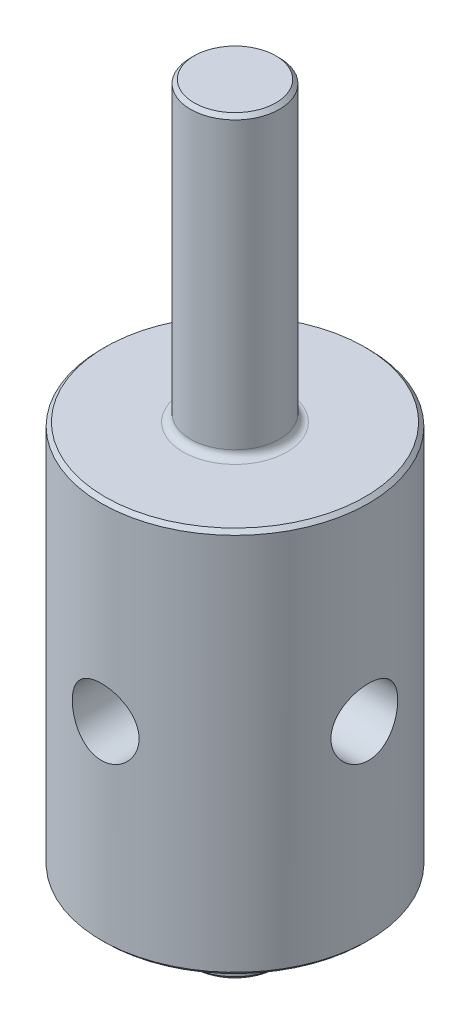
ISO-10303-21;
HEADER;
FILE_DESCRIPTION(('STEP AP214'),'2;1');
FILE_NAME('part.step','',(''),(''),'','','');
FILE_SCHEMA(('AUTOMOTIVE_DESIGN { 1 0 10303 214 1 1 1 1 }'));
ENDSEC;
DATA;
#1=APPLICATION_CONTEXT('core data for automotive mechanical design processes');
#2=APPLICATION_PROTOCOL_DEFINITION('international standard','automotive_design',2000,#1);
#3=PRODUCT_CONTEXT('',#1,'mechanical');
#4=PRODUCT('Part','Part','',(#3));
#5=PRODUCT_RELATED_PRODUCT_CATEGORY('part','',(#4));
#6=PRODUCT_DEFINITION_FORMATION('','',#4);
#7=PRODUCT_DEFINITION_CONTEXT('part definition',#1,'design');
#8=PRODUCT_DEFINITION('design','',#6,#7);
#9=PRODUCT_DEFINITION_SHAPE('','',#8);
#10=(LENGTH_UNIT() NAMED_UNIT(*) SI_UNIT(.MILLI.,.METRE.));
#11=(NAMED_UNIT(*) PLANE_ANGLE_UNIT() SI_UNIT($,.RADIAN.));
#12=(NAMED_UNIT(*) SI_UNIT($,.STERADIAN.) SOLID_ANGLE_UNIT());
#13=UNCERTAINTY_MEASURE_WITH_UNIT(LENGTH_MEASURE(1.E-05),#10,'distance_accuracy_value','');
#14=(GEOMETRIC_REPRESENTATION_CONTEXT(3) GLOBAL_UNCERTAINTY_ASSIGNED_CONTEXT((#13)) GLOBAL_UNIT_ASSIGNED_CONTEXT((#10,
#11,#12)) REPRESENTATION_CONTEXT('',''));
#15=CARTESIAN_POINT('',(0.,0.,0.));
#16=DIRECTION('',(0.,0.,1.));
#17=DIRECTION('',(1.,0.,0.));
#18=AXIS2_PLACEMENT_3D('',#15,#16,#17);
#19=CARTESIAN_POINT('',(3.,-17.5,0.));
#20=DIRECTION('',(0.,-1.,0.));
#21=DIRECTION('',(0.,0.,-1.));
#22=AXIS2_PLACEMENT_3D('',#19,#20,#21);
#23=PLANE('',#22);
#24=CARTESIAN_POINT('',(0.,-17.5,0.));
#25=DIRECTION('',(0.,-1.,0.));
#26=DIRECTION('',(0.,0.,-1.));
#27=AXIS2_PLACEMENT_3D('',#24,#25,#26);
#28=CIRCLE('',#27,2.75);
#29=CARTESIAN_POINT('',(0.,-17.5,-2.75));
#30=VERTEX_POINT('',#29);
#31=EDGE_CURVE('E75',#30,#30,#28,.T.);
#32=ORIENTED_EDGE('',*,*,#31,.T.);
#33=EDGE_LOOP('',(#32));
#34=FACE_BOUND('',#33,.T.);
#35=ADVANCED_FACE('F37',(#34),#23,.T.);
#36=CARTESIAN_POINT('',(0.,33.,0.));
#37=DIRECTION('',(0.,1.,0.));
#38=DIRECTION('',(0.,0.,1.));
#39=AXIS2_PLACEMENT_3D('',#36,#37,#38);
#40=PLANE('',#39);
#41=CARTESIAN_POINT('',(0.,33.,0.));
#42=DIRECTION('',(0.,1.,0.));
#43=DIRECTION('',(0.,0.,1.));
#44=AXIS2_PLACEMENT_3D('',#41,#42,#43);
#45=CIRCLE('',#44,2.75);
#46=CARTESIAN_POINT('',(0.,33.,2.75));
#47=VERTEX_POINT('',#46);
#48=EDGE_CURVE('E84',#47,#47,#45,.T.);
#49=ORIENTED_EDGE('',*,*,#48,.T.);
#50=EDGE_LOOP('',(#49));
#51=FACE_BOUND('',#50,.T.);
#52=ADVANCED_FACE('F126',(#51),#40,.T.);
#53=CARTESIAN_POINT('',(0.,0.,0.));
#54=DIRECTION('',(0.,-1.,0.));
#55=DIRECTION('',(0.,0.,-1.));
#56=AXIS2_PLACEMENT_3D('',#53,#54,#55);
#57=CYLINDRICAL_SURFACE('',#56,3.);
#58=CARTESIAN_POINT('',(0.,32.75,0.));
#59=DIRECTION('',(0.,1.,0.));
#60=DIRECTION('',(0.,0.,1.));
#61=AXIS2_PLACEMENT_3D('',#58,#59,#60);
#62=CIRCLE('',#61,3.);
#63=CARTESIAN_POINT('',(0.,32.75,3.));
#64=VERTEX_POINT('',#63);
#65=EDGE_CURVE('E81',#64,#64,#62,.F.);
#66=ORIENTED_EDGE('',*,*,#65,.T.);
#67=EDGE_LOOP('',(#66));
#68=FACE_BOUND('',#67,.T.);
#69=CARTESIAN_POINT('',(0.,13.5,0.));
#70=DIRECTION('',(0.,1.,0.));
#71=DIRECTION('',(0.,0.,1.));
#72=AXIS2_PLACEMENT_3D('',#69,#70,#71);
#73=CIRCLE('',#72,3.);
#74=CARTESIAN_POINT('',(0.,13.5,3.));
#75=VERTEX_POINT('',#74);
#76=EDGE_CURVE('E72',#75,#75,#73,.T.);
#77=ORIENTED_EDGE('',*,*,#76,.T.);
#78=EDGE_LOOP('',(#77));
#79=FACE_BOUND('',#78,.T.);
#80=ADVANCED_FACE('F132',(#68,#79),#57,.T.);
#81=CARTESIAN_POINT('',(9.,13.,0.));
#82=DIRECTION('',(0.,1.,0.));
#83=DIRECTION('',(0.,0.,1.));
#84=AXIS2_PLACEMENT_3D('',#81,#82,#83);
#85=PLANE('',#84);
#86=CARTESIAN_POINT('',(0.,13.,0.));
#87=DIRECTION('',(0.,1.,0.));
#88=DIRECTION('',(0.,0.,1.));
#89=AXIS2_PLACEMENT_3D('',#86,#87,#88);
#90=CIRCLE('',#89,8.74999999999999);
#91=CARTESIAN_POINT('',(0.,13.,8.74999999999999));
#92=VERTEX_POINT('',#91);
#93=EDGE_CURVE('E11',#92,#92,#90,.T.);
#94=ORIENTED_EDGE('',*,*,#93,.T.);
#95=EDGE_LOOP('',(#94));
#96=FACE_BOUND('',#95,.T.);
#97=CARTESIAN_POINT('',(0.,13.,0.));
#98=DIRECTION('',(0.,1.,0.));
#99=DIRECTION('',(0.,0.,1.));
#100=AXIS2_PLACEMENT_3D('',#97,#98,#99);
#101=CIRCLE('',#100,3.5);
#102=CARTESIAN_POINT('',(0.,13.,3.5));
#103=VERTEX_POINT('',#102);
#104=EDGE_CURVE('E69',#103,#103,#101,.F.);
#105=ORIENTED_EDGE('',*,*,#104,.T.);
#106=EDGE_LOOP('',(#105));
#107=FACE_BOUND('',#106,.T.);
#108=ADVANCED_FACE('F154',(#96,#107),#85,.T.);
#109=CARTESIAN_POINT('',(0.,0.,0.));
#110=DIRECTION('',(0.,-1.,0.));
#111=DIRECTION('',(0.,0.,-1.));
#112=AXIS2_PLACEMENT_3D('',#109,#110,#111);
#113=CYLINDRICAL_SURFACE('',#112,9.);
#114=CARTESIAN_POINT('',(0.,-12.75,0.));
#115=DIRECTION('',(0.,-1.,0.));
#116=DIRECTION('',(0.,0.,-1.));
#117=AXIS2_PLACEMENT_3D('',#114,#115,#116);
#118=CIRCLE('',#117,9.);
#119=CARTESIAN_POINT('',(0.,-12.75,-9.));
#120=VERTEX_POINT('',#119);
#121=EDGE_CURVE('E45',#120,#120,#118,.F.);
#122=ORIENTED_EDGE('',*,*,#121,.T.);
#123=EDGE_LOOP('',(#122));
#124=FACE_BOUND('',#123,.T.);
#125=CARTESIAN_POINT('',(0.,12.75,0.));
#126=DIRECTION('',(0.,1.,0.));
#127=DIRECTION('',(0.,0.,1.));
#128=AXIS2_PLACEMENT_3D('',#125,#126,#127);
#129=CIRCLE('',#128,9.);
#130=CARTESIAN_POINT('',(0.,12.75,9.));
#131=VERTEX_POINT('',#130);
#132=EDGE_CURVE('E90',#131,#131,#129,.F.);
#133=ORIENTED_EDGE('',*,*,#132,.T.);
#134=EDGE_LOOP('',(#133));
#135=FACE_BOUND('',#134,.T.);
#136=CARTESIAN_POINT('',(2.24999999999999,0.,8.71421252896669));
#137=CARTESIAN_POINT('',(2.24999647073376,0.124245675833919,8.71421490079074));
#138=CARTESIAN_POINT('',(2.23967362094788,0.248530408810669,8.71689875413138));
#139=CARTESIAN_POINT('',(2.19872081291741,0.493530820356157,8.72731675793308));
#140=CARTESIAN_POINT('',(2.16807903606789,0.614244379021365,8.73505384759467));
#141=CARTESIAN_POINT('',(2.08754207966883,0.848523184368461,8.75464852136536));
#142=CARTESIAN_POINT('',(2.03767175506903,0.962097439847133,8.76650078421412));
#143=CARTESIAN_POINT('',(1.92016902713524,1.17927976728589,8.79298372825883));
#144=CARTESIAN_POINT('',(1.85253586970461,1.28288741587219,8.80761452740641));
#145=CARTESIAN_POINT('',(1.69983758458069,1.47947548073599,8.83836644720063));
#146=CARTESIAN_POINT('',(1.61445319893364,1.57220424031504,8.85451137860731));
#147=CARTESIAN_POINT('',(1.42936385769059,1.7421852549243,8.88626587963765));
#148=CARTESIAN_POINT('',(1.32965756476227,1.81943606305957,8.9018753990975));
#149=CARTESIAN_POINT('',(1.11703068097106,1.95729792086814,8.93106373968524));
#150=CARTESIAN_POINT('',(1.0039451185756,2.01766174934531,8.94461118660534));
#151=CARTESIAN_POINT('',(0.768836865863483,2.11842867973777,8.96787730733386));
#152=CARTESIAN_POINT('',(0.646815497212744,2.15883472672396,8.9775965460091));
#153=CARTESIAN_POINT('',(0.399922882878743,2.21773305112072,8.99194282963362));
#154=CARTESIAN_POINT('',(0.275159447594076,2.23665267989392,8.99666904459883));
#155=CARTESIAN_POINT('',(0.0241459373364916,2.25338254134799,9.00084234696568));
#156=CARTESIAN_POINT('',(-0.102103915084262,2.25119589498863,9.00029021487035));
#157=CARTESIAN_POINT('',(-0.349542556137871,2.22608263477486,8.9940428545818));
#158=CARTESIAN_POINT('',(-0.4707814851024,2.20361730745152,8.98846202106784));
#159=CARTESIAN_POINT('',(-0.707711056680792,2.13932585695634,8.97291752872372));
#160=CARTESIAN_POINT('',(-0.823401403583483,2.09749870316032,8.96295363658607));
#161=CARTESIAN_POINT('',(-1.04716508287906,1.99529768638164,8.93958758730796));
#162=CARTESIAN_POINT('',(-1.15516014697463,1.93475965980442,8.9261551772551));
#163=CARTESIAN_POINT('',(-1.3596201502661,1.79697988879536,8.89730913428723));
#164=CARTESIAN_POINT('',(-1.45608307894238,1.71973523829543,8.88189515687385));
#165=CARTESIAN_POINT('',(-1.63749157894114,1.54826213221586,8.85027342392421));
#166=CARTESIAN_POINT('',(-1.72205477791919,1.45363059688702,8.83405547572768));
#167=CARTESIAN_POINT('',(-1.87419684591679,1.25136002381374,8.80303539165595));
#168=CARTESIAN_POINT('',(-1.94177492110356,1.143720378458,8.7882333219746));
#169=CARTESIAN_POINT('',(-2.05827329030081,0.917738969266022,8.76168447146387));
#170=CARTESIAN_POINT('',(-2.10710152568351,0.799347842718474,8.74995285345307));
#171=CARTESIAN_POINT('',(-2.18404264643185,0.555673078730839,8.73106776133802));
#172=CARTESIAN_POINT('',(-2.21215996474439,0.430390922413861,8.7239133075846));
#173=CARTESIAN_POINT('',(-2.24624667479932,0.180036448623072,8.71519820406711));
#174=CARTESIAN_POINT('',(-2.2527814265272,0.055045985993078,8.71349480079241));
#175=CARTESIAN_POINT('',(-2.24506529146364,-0.194239742926728,8.71548609028224));
#176=CARTESIAN_POINT('',(-2.23081631806481,-0.318535072154497,8.71918028613271));
#177=CARTESIAN_POINT('',(-2.18243291754442,-0.560802838453714,8.73141373786482));
#178=CARTESIAN_POINT('',(-2.14862766145371,-0.678845453912277,8.73987273218279));
#179=CARTESIAN_POINT('',(-2.06245627350341,-0.907588312067992,8.76060646436525));
#180=CARTESIAN_POINT('',(-2.01008794294125,-1.0182876831502,8.77288165421767));
#181=CARTESIAN_POINT('',(-1.88709360114293,-1.2315971500802,8.80016523385961));
#182=CARTESIAN_POINT('',(-1.81612957845207,-1.33400595603868,8.81522251746521));
#183=CARTESIAN_POINT('',(-1.65838565910251,-1.52566952652132,8.84625374764002));
#184=CARTESIAN_POINT('',(-1.57160316331223,-1.61492212498509,8.86222784455476));
#185=CARTESIAN_POINT('',(-1.38209112221563,-1.78002993831383,8.89377662728596));
#186=CARTESIAN_POINT('',(-1.27901689319608,-1.85549405629392,8.90933131855692));
#187=CARTESIAN_POINT('',(-1.06133103606301,-1.98804228025612,8.93787494952321));
#188=CARTESIAN_POINT('',(-0.946720010154576,-2.04512734494738,8.95086402303554));
#189=CARTESIAN_POINT('',(-0.710005953894951,-2.13880143107513,8.97273104164493));
#190=CARTESIAN_POINT('',(-0.587964107312732,-2.17553785594115,8.98163847020169));
#191=CARTESIAN_POINT('',(-0.339186960717314,-2.22791430114757,8.9944676405621));
#192=CARTESIAN_POINT('',(-0.21245257134279,-2.24355839286513,8.9983903445408));
#193=CARTESIAN_POINT('',(0.0384379344974779,-2.25307707654496,9.00076881169814));
#194=CARTESIAN_POINT('',(0.16257111067355,-2.24752884546466,8.99936952479974));
#195=CARTESIAN_POINT('',(0.408076866933189,-2.21614238858771,8.99158267029248));
#196=CARTESIAN_POINT('',(0.529449529007088,-2.19030476622036,8.98519525103631));
#197=CARTESIAN_POINT('',(0.76538483020074,-2.11938250551555,8.96817223921251));
#198=CARTESIAN_POINT('',(0.87998061280694,-2.07440223004264,8.95755970130383));
#199=CARTESIAN_POINT('',(1.10006336934365,-1.96656619720596,8.93320400055731));
#200=CARTESIAN_POINT('',(1.20554919284767,-1.9037081864914,8.91946044312205));
#201=CARTESIAN_POINT('',(1.40715433895243,-1.76014072350869,8.88991311780646));
#202=CARTESIAN_POINT('',(1.50298872367125,-1.67903967846638,8.87406788118746));
#203=CARTESIAN_POINT('',(1.67988379561538,-1.50204858305096,8.84228960378677));
#204=CARTESIAN_POINT('',(1.76094073142232,-1.40615478874988,8.8263565417643));
#205=CARTESIAN_POINT('',(1.90746455956161,-1.20014681807371,8.79586820652381));
#206=CARTESIAN_POINT('',(1.97261239368685,-1.08980072242817,8.781344182649));
#207=CARTESIAN_POINT('',(2.0833355173173,-0.859375147781654,8.75573899863364));
#208=CARTESIAN_POINT('',(2.12892504694234,-0.739302826288843,8.74465533524731));
#209=CARTESIAN_POINT('',(2.19245068928475,-0.516201723370887,8.72891794689159));
#210=CARTESIAN_POINT('',(2.21398463384297,-0.414240380131191,8.72344491757873));
#211=CARTESIAN_POINT('',(2.24276015828647,-0.208195044755201,8.71609136810896));
#212=CARTESIAN_POINT('',(2.25000295733643,-0.104111234450095,8.71421054150493));
#213=CARTESIAN_POINT('',(2.24999999999999,0.,8.71421252896669));
#214=B_SPLINE_CURVE_WITH_KNOTS('',3,(#136,#137,#138,#139,#140,#141,#142,#143,#144,#145,#146,
#147,#148,#149,#150,#151,#152,#153,#154,#155,#156,#157,#158,#159,#160,#161,#162,#163,#164,#165,
#166,#167,#168,#169,#170,#171,#172,#173,#174,#175,#176,#177,#178,#179,#180,#181,#182,#183,#184,
#185,#186,#187,#188,#189,#190,#191,#192,#193,#194,#195,#196,#197,#198,#199,#200,#201,#202,#203,
#204,#205,#206,#207,#208,#209,#210,#211,#212,#213),.UNSPECIFIED.,.T.,.F.,(4,2,2,2,2,2,2,2,2,2,2,
2,2,2,2,2,2,2,2,2,2,2,2,2,2,2,2,2,2,2,2,2,2,2,2,2,2,2,4),(0.,0.372354697562521,
0.744926167285797,1.11701765444941,1.4891249407993,1.86861558773678,2.24814169331879,
2.63296346758127,3.01772843862382,3.39469875895811,3.77161333799417,4.14016436420051,
4.50873501052306,4.88063586828998,5.2526014692202,5.63463419914719,6.0166847807982,
6.4005878880756,6.78440880116591,7.15809217287781,7.5317411446987,7.89927664512734,
8.26685569283724,8.64164561277689,9.01649717000987,9.40072797873234,9.78493874152045,
10.1663286553068,10.5476449402258,10.9186510151916,11.2896460564373,11.6586438890819,
12.0276882516871,12.4055738692831,12.783555284134,13.1685882956202,13.5533404923751,
13.8653804446715,14.1773937759712),.UNSPECIFIED.);
#215=CARTESIAN_POINT('',(2.24999999999999,0.,8.71421252896669));
#216=VERTEX_POINT('',#215);
#217=EDGE_CURVE('E183',#216,#216,#214,.T.);
#218=ORIENTED_EDGE('',*,*,#217,.F.);
#219=EDGE_LOOP('',(#218));
#220=FACE_BOUND('',#219,.T.);
#221=CARTESIAN_POINT('',(9.,-2.24999999999999,0.));
#222=CARTESIAN_POINT('',(8.99999789802018,-2.24999651139275,-0.124314133004598));
#223=CARTESIAN_POINT('',(8.9973986719774,-2.23966267383931,-0.248667236746146));
#224=CARTESIAN_POINT('',(8.98728170744842,-2.19866227303948,-0.493809485655799));
#225=CARTESIAN_POINT('',(8.97976118129964,-2.16798418569322,-0.614596570306109));
#226=CARTESIAN_POINT('',(8.96063439498049,-2.08734111980686,-0.849031308273864));
#227=CARTESIAN_POINT('',(8.94903304263088,-2.03739930192709,-0.962687345145002));
#228=CARTESIAN_POINT('',(8.92298015711432,-1.91972791493273,-1.18000819785664));
#229=CARTESIAN_POINT('',(8.90852852781235,-1.85199774582154,-1.28367267652314));
#230=CARTESIAN_POINT('',(8.8780112038754,-1.69919881551872,-1.48020289095137));
#231=CARTESIAN_POINT('',(8.8619206072219,-1.6138326375614,-1.57283353509158));
#232=CARTESIAN_POINT('',(8.83010430176905,-1.42882169263644,-1.74262339080498));
#233=CARTESIAN_POINT('',(8.81437863434802,-1.32917531557959,-1.81978085542378));
#234=CARTESIAN_POINT('',(8.78482163547253,-1.11660715989451,-1.95753981419846));
#235=CARTESIAN_POINT('',(8.77102191697217,-1.00351015378691,-2.0178783238877));
#236=CARTESIAN_POINT('',(8.74724242227025,-0.768377382509946,-2.11859536282611));
#237=CARTESIAN_POINT('',(8.73726203541628,-0.646343050001977,-2.15897708316021));
#238=CARTESIAN_POINT('',(8.72250715044484,-0.399384752697511,-2.21783225520714));
#239=CARTESIAN_POINT('',(8.71763236495517,-0.274567655943013,-2.23672840249807));
#240=CARTESIAN_POINT('',(8.71334043689387,-0.0234471465009838,-2.25339266259961));
#241=CARTESIAN_POINT('',(8.71392240641893,0.102856021038203,-2.25116421272716));
#242=CARTESIAN_POINT('',(8.72038808275226,0.350123711618027,-2.22597978695955));
#243=CARTESIAN_POINT('',(8.72614294510941,0.471143432197992,-2.20352751028595));
#244=CARTESIAN_POINT('',(8.74210064506604,0.707641576366584,-2.13933628035449));
#245=CARTESIAN_POINT('',(8.75230379953858,0.823119604543377,-2.09759595310409));
#246=CARTESIAN_POINT('',(8.77612670858489,1.04660702437819,-1.99558421690578));
#247=CARTESIAN_POINT('',(8.78977991204724,1.15452925768435,-1.93513000084938));
#248=CARTESIAN_POINT('',(8.81894566268987,1.35887806463522,-1.79753441402242));
#249=CARTESIAN_POINT('',(8.83445853501942,1.45530262210087,-1.72039012321325));
#250=CARTESIAN_POINT('',(8.86613820809837,1.6368054235416,-1.54899513702183));
#251=CARTESIAN_POINT('',(8.88231104217002,1.72148173509202,-1.45431938724879));
#252=CARTESIAN_POINT('',(8.91308948368134,1.87383186369585,-1.25191787625555));
#253=CARTESIAN_POINT('',(8.92769504324111,1.94150516139534,-1.14419171656192));
#254=CARTESIAN_POINT('',(8.95376598141286,2.05807587933657,-0.918173833022089));
#255=CARTESIAN_POINT('',(8.96522040191591,2.10690801038163,-0.799847089812937));
#256=CARTESIAN_POINT('',(8.98361875487125,2.18387595856435,-0.556314012214327));
#257=CARTESIAN_POINT('',(8.99056355008921,2.2120157346272,-0.43110899872573));
#258=CARTESIAN_POINT('',(8.99903248907063,2.24618634833825,-0.180809955585044));
#259=CARTESIAN_POINT('',(9.00069080262418,2.25276453911294,-0.0557950799823191));
#260=CARTESIAN_POINT('',(8.99878207221676,2.24512649691676,0.193549312202257));
#261=CARTESIAN_POINT('',(8.9952154986277,2.23091213580129,0.317878889466887));
#262=CARTESIAN_POINT('',(8.98334371691036,2.18254363741292,0.560421403164731));
#263=CARTESIAN_POINT('',(8.97510951278717,2.14868810478451,0.678697678453124));
#264=CARTESIAN_POINT('',(8.95483059951201,2.06233937395732,0.907885938678759));
#265=CARTESIAN_POINT('',(8.94278550554838,2.00984429353024,1.01879717854894));
#266=CARTESIAN_POINT('',(8.91589961889466,1.8866458066879,1.23228470164476));
#267=CARTESIAN_POINT('',(8.90101301050399,1.81563583140485,1.33467816275374));
#268=CARTESIAN_POINT('',(8.87016763781129,1.65781513680454,1.52628992046486));
#269=CARTESIAN_POINT('',(8.85420868877558,1.57100169057463,1.6155059384595));
#270=CARTESIAN_POINT('',(8.82253435441157,1.3814970587333,1.78048585210909));
#271=CARTESIAN_POINT('',(8.80683456280922,1.27846844549636,1.85586580143304));
#272=CARTESIAN_POINT('',(8.77789317565859,1.06090104830142,1.98826613851904));
#273=CARTESIAN_POINT('',(8.7646514710054,0.946362775560368,2.04528734123689));
#274=CARTESIAN_POINT('',(8.74227142101998,0.709641416380381,2.13892713091393));
#275=CARTESIAN_POINT('',(8.73310882937859,0.587508557483985,2.17566659498109));
#276=CARTESIAN_POINT('',(8.71990116135276,0.338535543166336,2.22801848993066));
#277=CARTESIAN_POINT('',(8.71585496579905,0.211696423451264,2.24363554121798));
#278=CARTESIAN_POINT('',(8.71342351805936,-0.0391815357828033,2.25305788550098));
#279=CARTESIAN_POINT('',(8.71487899092396,-0.163196152687095,2.24747684667017));
#280=CARTESIAN_POINT('',(8.72291863511765,-0.408455833001969,2.21606591746929));
#281=CARTESIAN_POINT('',(8.72950270337786,-0.529700952020473,2.19023643403014));
#282=CARTESIAN_POINT('',(8.74696891024084,-0.765312688598109,2.11939697916418));
#283=CARTESIAN_POINT('',(8.75782522854464,-0.879715957860307,2.07450210702055));
#284=CARTESIAN_POINT('',(8.78261633587243,-1.09944807407053,1.9668973704076));
#285=CARTESIAN_POINT('',(8.7965515518116,-1.20477565978037,1.90418503505127));
#286=CARTESIAN_POINT('',(8.82638451395269,-1.40633194350303,1.7608016229557));
#287=CARTESIAN_POINT('',(8.84232397247636,-1.50225161013593,1.67970474436837));
#288=CARTESIAN_POINT('',(8.87412040869429,-1.67932056719311,1.50268405678459));
#289=CARTESIAN_POINT('',(8.8899773659059,-1.76046634516945,1.40675673189171));
#290=CARTESIAN_POINT('',(8.92016483471495,-1.9071169628469,1.20070138005388));
#291=CARTESIAN_POINT('',(8.93446250048802,-1.97231192050736,1.09034763347457));
#292=CARTESIAN_POINT('',(8.95957387462678,-2.08312119441079,0.859899089265708));
#293=CARTESIAN_POINT('',(8.97039007799672,-2.1287495409728,0.739811345155103));
#294=CARTESIAN_POINT('',(8.98572089348313,-2.19235774549447,0.516615379865202));
#295=CARTESIAN_POINT('',(8.99103877579036,-2.21392686458014,0.414570256362098));
#296=CARTESIAN_POINT('',(8.99817907847923,-2.2427489154329,0.208359107304421));
#297=CARTESIAN_POINT('',(9.00000176176341,-2.25000292395794,0.104193241863922));
#298=CARTESIAN_POINT('',(9.,-2.24999999999999,0.));
#299=B_SPLINE_CURVE_WITH_KNOTS('',3,(#221,#222,#223,#224,#225,#226,#227,#228,#229,#230,#231,
#232,#233,#234,#235,#236,#237,#238,#239,#240,#241,#242,#243,#244,#245,#246,#247,#248,#249,#250,
#251,#252,#253,#254,#255,#256,#257,#258,#259,#260,#261,#262,#263,#264,#265,#266,#267,#268,#269,
#270,#271,#272,#273,#274,#275,#276,#277,#278,#279,#280,#281,#282,#283,#284,#285,#286,#287,#288,
#289,#290,#291,#292,#293,#294,#295,#296,#297,#298),.UNSPECIFIED.,.T.,.F.,(4,2,2,2,2,2,2,2,2,2,2,
2,2,2,2,2,2,2,2,2,2,2,2,2,2,2,2,2,2,2,2,2,2,2,2,2,2,2,4),(0.,0.372560568707833,
0.745332356645847,1.11765735342915,1.48999491025399,1.86921653155708,2.24848094370092,
2.63337971318709,3.01821691754052,3.39534442651604,3.77241057174025,4.14033745515507,
4.50829055204037,4.87995791815798,5.25169036259223,5.63402251458508,6.0163663434235,
6.4000234351865,6.78360710537943,7.15737463428893,7.53110851674093,7.89930411776034,
8.26753690988414,8.64230381353006,9.01713544517006,9.40116763811692,9.7851827812924,
10.1668838192603,10.5485013488359,10.919156706029,11.2898046143903,11.6582460084415,
12.0267385221033,12.4048436461984,12.783038546606,13.1680827825436,13.55285045737,
13.865133644182,14.1773933406954),.UNSPECIFIED.);
#300=CARTESIAN_POINT('',(9.,-2.24999999999999,0.));
#301=VERTEX_POINT('',#300);
#302=EDGE_CURVE('E56',#301,#301,#299,.T.);
#303=ORIENTED_EDGE('',*,*,#302,.F.);
#304=EDGE_LOOP('',(#303));
#305=FACE_BOUND('',#304,.T.);
#306=CARTESIAN_POINT('',(-8.71421252896669,0.,2.24999999999999));
#307=CARTESIAN_POINT('',(-8.71421490079075,0.124245675833919,2.24999647073376));
#308=CARTESIAN_POINT('',(-8.71689875413138,0.248530408810669,2.23967362094788));
#309=CARTESIAN_POINT('',(-8.72731675793308,0.493530820356157,2.19872081291741));
#310=CARTESIAN_POINT('',(-8.73505384759467,0.614244379021365,2.16807903606789));
#311=CARTESIAN_POINT('',(-8.75464852136536,0.848523184368461,2.08754207966883));
#312=CARTESIAN_POINT('',(-8.76650078421412,0.962097439847134,2.03767175506903));
#313=CARTESIAN_POINT('',(-8.79298372825883,1.17927976728589,1.92016902713524));
#314=CARTESIAN_POINT('',(-8.80761452740641,1.28288741587219,1.85253586970461));
#315=CARTESIAN_POINT('',(-8.83836644720063,1.47947548073599,1.69983758458069));
#316=CARTESIAN_POINT('',(-8.85451137860731,1.57220424031504,1.61445319893364));
#317=CARTESIAN_POINT('',(-8.88626587963765,1.7421852549243,1.42936385769059));
#318=CARTESIAN_POINT('',(-8.9018753990975,1.81943606305957,1.32965756476227));
#319=CARTESIAN_POINT('',(-8.93106373968524,1.95729792086814,1.11703068097105));
#320=CARTESIAN_POINT('',(-8.94461118660534,2.01766174934531,1.0039451185756));
#321=CARTESIAN_POINT('',(-8.96787730733386,2.11842867973777,0.768836865863482));
#322=CARTESIAN_POINT('',(-8.9775965460091,2.15883472672396,0.646815497212743));
#323=CARTESIAN_POINT('',(-8.99194282963362,2.21773305112072,0.399922882878743));
#324=CARTESIAN_POINT('',(-8.99666904459883,2.23665267989392,0.275159447594076));
#325=CARTESIAN_POINT('',(-9.00084234696568,2.25338254134799,0.0241459373364911));
#326=CARTESIAN_POINT('',(-9.00029021487035,2.25119589498863,-0.102103915084263));
#327=CARTESIAN_POINT('',(-8.9940428545818,2.22608263477486,-0.349542556137871));
#328=CARTESIAN_POINT('',(-8.98846202106784,2.20361730745152,-0.4707814851024));
#329=CARTESIAN_POINT('',(-8.97291752872372,2.13932585695634,-0.707711056680792));
#330=CARTESIAN_POINT('',(-8.96295363658607,2.09749870316032,-0.823401403583484));
#331=CARTESIAN_POINT('',(-8.93958758730796,1.99529768638164,-1.04716508287906));
#332=CARTESIAN_POINT('',(-8.9261551772551,1.93475965980442,-1.15516014697463));
#333=CARTESIAN_POINT('',(-8.89730913428723,1.79697988879536,-1.3596201502661));
#334=CARTESIAN_POINT('',(-8.88189515687385,1.71973523829543,-1.45608307894239));
#335=CARTESIAN_POINT('',(-8.85027342392421,1.54826213221586,-1.63749157894115));
#336=CARTESIAN_POINT('',(-8.83405547572768,1.45363059688702,-1.72205477791919));
#337=CARTESIAN_POINT('',(-8.80303539165595,1.25136002381374,-1.87419684591679));
#338=CARTESIAN_POINT('',(-8.7882333219746,1.143720378458,-1.94177492110356));
#339=CARTESIAN_POINT('',(-8.76168447146387,0.917738969266021,-2.05827329030081));
#340=CARTESIAN_POINT('',(-8.74995285345307,0.799347842718473,-2.10710152568351));
#341=CARTESIAN_POINT('',(-8.73106776133802,0.555673078730838,-2.18404264643185));
#342=CARTESIAN_POINT('',(-8.7239133075846,0.43039092241386,-2.21215996474439));
#343=CARTESIAN_POINT('',(-8.71519820406711,0.180036448623071,-2.24624667479932));
#344=CARTESIAN_POINT('',(-8.71349480079241,0.0550459859930763,-2.2527814265272));
#345=CARTESIAN_POINT('',(-8.71548609028224,-0.19423974292673,-2.24506529146364));
#346=CARTESIAN_POINT('',(-8.71918028613271,-0.318535072154498,-2.23081631806481));
#347=CARTESIAN_POINT('',(-8.73141373786482,-0.560802838453716,-2.18243291754442));
#348=CARTESIAN_POINT('',(-8.73987273218279,-0.678845453912278,-2.14862766145371));
#349=CARTESIAN_POINT('',(-8.76060646436525,-0.907588312067993,-2.06245627350341));
#350=CARTESIAN_POINT('',(-8.77288165421767,-1.0182876831502,-2.01008794294124));
#351=CARTESIAN_POINT('',(-8.80016523385961,-1.2315971500802,-1.88709360114293));
#352=CARTESIAN_POINT('',(-8.81522251746521,-1.33400595603868,-1.81612957845207));
#353=CARTESIAN_POINT('',(-8.84625374764002,-1.52566952652132,-1.65838565910251));
#354=CARTESIAN_POINT('',(-8.86222784455476,-1.61492212498509,-1.57160316331223));
#355=CARTESIAN_POINT('',(-8.89377662728596,-1.78002993831383,-1.38209112221563));
#356=CARTESIAN_POINT('',(-8.90933131855692,-1.85549405629392,-1.27901689319608));
#357=CARTESIAN_POINT('',(-8.93787494952321,-1.98804228025612,-1.06133103606301));
#358=CARTESIAN_POINT('',(-8.95086402303554,-2.04512734494738,-0.946720010154575));
#359=CARTESIAN_POINT('',(-8.97273104164493,-2.13880143107513,-0.71000595389495));
#360=CARTESIAN_POINT('',(-8.98163847020169,-2.17553785594115,-0.587964107312732));
#361=CARTESIAN_POINT('',(-8.9944676405621,-2.22791430114757,-0.339186960717313));
#362=CARTESIAN_POINT('',(-8.9983903445408,-2.24355839286513,-0.212452571342789));
#363=CARTESIAN_POINT('',(-9.00076881169814,-2.25307707654496,0.0384379344974786));
#364=CARTESIAN_POINT('',(-8.99936952479974,-2.24752884546466,0.16257111067355));
#365=CARTESIAN_POINT('',(-8.99158267029248,-2.21614238858771,0.40807686693319));
#366=CARTESIAN_POINT('',(-8.98519525103631,-2.19030476622036,0.529449529007089));
#367=CARTESIAN_POINT('',(-8.96817223921251,-2.11938250551555,0.765384830200741));
#368=CARTESIAN_POINT('',(-8.95755970130383,-2.07440223004264,0.87998061280694));
#369=CARTESIAN_POINT('',(-8.9332040005573,-1.96656619720595,1.10006336934365));
#370=CARTESIAN_POINT('',(-8.91946044312205,-1.9037081864914,1.20554919284767));
#371=CARTESIAN_POINT('',(-8.88991311780646,-1.76014072350869,1.40715433895243));
#372=CARTESIAN_POINT('',(-8.87406788118746,-1.67903967846638,1.50298872367125));
#373=CARTESIAN_POINT('',(-8.84228960378677,-1.50204858305096,1.67988379561538));
#374=CARTESIAN_POINT('',(-8.8263565417643,-1.40615478874988,1.76094073142232));
#375=CARTESIAN_POINT('',(-8.79586820652381,-1.20014681807371,1.90746455956161));
#376=CARTESIAN_POINT('',(-8.781344182649,-1.08980072242817,1.97261239368685));
#377=CARTESIAN_POINT('',(-8.75573899863363,-0.859375147781653,2.0833355173173));
#378=CARTESIAN_POINT('',(-8.74465533524731,-0.739302826288842,2.12892504694234));
#379=CARTESIAN_POINT('',(-8.72891794689159,-0.516201723370886,2.19245068928475));
#380=CARTESIAN_POINT('',(-8.72344491757873,-0.41424038013119,2.21398463384297));
#381=CARTESIAN_POINT('',(-8.71609136810896,-0.208195044755201,2.24276015828647));
#382=CARTESIAN_POINT('',(-8.71421054150493,-0.104111234450094,2.25000295733643));
#383=CARTESIAN_POINT('',(-8.71421252896669,0.,2.24999999999999));
#384=B_SPLINE_CURVE_WITH_KNOTS('',3,(#306,#307,#308,#309,#310,#311,#312,#313,#314,#315,#316,
#317,#318,#319,#320,#321,#322,#323,#324,#325,#326,#327,#328,#329,#330,#331,#332,#333,#334,#335,
#336,#337,#338,#339,#340,#341,#342,#343,#344,#345,#346,#347,#348,#349,#350,#351,#352,#353,#354,
#355,#356,#357,#358,#359,#360,#361,#362,#363,#364,#365,#366,#367,#368,#369,#370,#371,#372,#373,
#374,#375,#376,#377,#378,#379,#380,#381,#382,#383),.UNSPECIFIED.,.T.,.F.,(4,2,2,2,2,2,2,2,2,2,2,
2,2,2,2,2,2,2,2,2,2,2,2,2,2,2,2,2,2,2,2,2,2,2,2,2,2,2,4),(0.,0.372354697562522,
0.744926167285797,1.11701765444942,1.4891249407993,1.86861558773678,2.24814169331879,
2.63296346758127,3.01772843862382,3.39469875895811,3.77161333799417,4.14016436420051,
4.50873501052306,4.88063586828998,5.2526014692202,5.63463419914719,6.0166847807982,
6.4005878880756,6.78440880116591,7.15809217287782,7.5317411446987,7.89927664512734,
8.26685569283724,8.64164561277689,9.01649717000988,9.40072797873234,9.78493874152045,
10.1663286553068,10.5476449402258,10.9186510151916,11.2896460564373,11.6586438890819,
12.0276882516871,12.4055738692831,12.783555284134,13.1685882956202,13.5533404923751,
13.8653804446715,14.1773937759712),.UNSPECIFIED.);
#385=CARTESIAN_POINT('',(-8.71421252896669,0.,2.24999999999999));
#386=VERTEX_POINT('',#385);
#387=EDGE_CURVE('E170',#386,#386,#384,.T.);
#388=ORIENTED_EDGE('',*,*,#387,.F.);
#389=EDGE_LOOP('',(#388));
#390=FACE_BOUND('',#389,.T.);
#391=ADVANCED_FACE('F95',(#124,#135,#220,#305,#390),#113,.T.);
#392=CARTESIAN_POINT('',(3.,-13.,0.));
#393=DIRECTION('',(0.,-1.,0.));
#394=DIRECTION('',(0.,0.,-1.));
#395=AXIS2_PLACEMENT_3D('',#392,#393,#394);
#396=PLANE('',#395);
#397=CARTESIAN_POINT('',(0.,-13.,0.));
#398=DIRECTION('',(0.,-1.,0.));
#399=DIRECTION('',(0.,0.,-1.));
#400=AXIS2_PLACEMENT_3D('',#397,#398,#399);
#401=CIRCLE('',#400,8.75000000000001);
#402=CARTESIAN_POINT('',(0.,-13.,-8.75000000000001));
#403=VERTEX_POINT('',#402);
#404=EDGE_CURVE('E87',#403,#403,#401,.T.);
#405=ORIENTED_EDGE('',*,*,#404,.T.);
#406=EDGE_LOOP('',(#405));
#407=FACE_BOUND('',#406,.T.);
#408=CARTESIAN_POINT('',(0.,-13.,0.));
#409=DIRECTION('',(0.,-1.,0.));
#410=DIRECTION('',(0.,0.,-1.));
#411=AXIS2_PLACEMENT_3D('',#408,#409,#410);
#412=CIRCLE('',#411,3.5);
#413=CARTESIAN_POINT('',(0.,-13.,-3.5));
#414=VERTEX_POINT('',#413);
#415=EDGE_CURVE('E63',#414,#414,#412,.F.);
#416=ORIENTED_EDGE('',*,*,#415,.T.);
#417=EDGE_LOOP('',(#416));
#418=FACE_BOUND('',#417,.T.);
#419=ADVANCED_FACE('F104',(#407,#418),#396,.T.);
#420=CARTESIAN_POINT('',(0.,0.,0.));
#421=DIRECTION('',(0.,-1.,0.));
#422=DIRECTION('',(0.,0.,-1.));
#423=AXIS2_PLACEMENT_3D('',#420,#421,#422);
#424=CYLINDRICAL_SURFACE('',#423,3.);
#425=CARTESIAN_POINT('',(0.,-17.25,0.));
#426=DIRECTION('',(0.,-1.,0.));
#427=DIRECTION('',(0.,0.,-1.));
#428=AXIS2_PLACEMENT_3D('',#425,#426,#427);
#429=CIRCLE('',#428,3.);
#430=CARTESIAN_POINT('',(0.,-17.25,-3.));
#431=VERTEX_POINT('',#430);
#432=EDGE_CURVE('E78',#431,#431,#429,.F.);
#433=ORIENTED_EDGE('',*,*,#432,.T.);
#434=EDGE_LOOP('',(#433));
#435=FACE_BOUND('',#434,.T.);
#436=CARTESIAN_POINT('',(0.,-13.5,0.));
#437=DIRECTION('',(0.,-1.,0.));
#438=DIRECTION('',(0.,0.,-1.));
#439=AXIS2_PLACEMENT_3D('',#436,#437,#438);
#440=CIRCLE('',#439,3.);
#441=CARTESIAN_POINT('',(0.,-13.5,-3.));
#442=VERTEX_POINT('',#441);
#443=EDGE_CURVE('E60',#442,#442,#440,.T.);
#444=ORIENTED_EDGE('',*,*,#443,.T.);
#445=EDGE_LOOP('',(#444));
#446=FACE_BOUND('',#445,.T.);
#447=ADVANCED_FACE('F107',(#435,#446),#424,.T.);
#448=CARTESIAN_POINT('',(-9.,0.,0.));
#449=DIRECTION('',(-1.,0.,0.));
#450=DIRECTION('',(0.,0.,1.));
#451=AXIS2_PLACEMENT_3D('',#448,#449,#450);
#452=CYLINDRICAL_SURFACE('',#451,2.24999999999999);
#453=CARTESIAN_POINT('',(0.,0.,0.));
#454=DIRECTION('',(-0.707106781186548,0.,-0.707106781186547));
#455=DIRECTION('',(-0.707106781186547,0.,0.707106781186548));
#456=AXIS2_PLACEMENT_3D('',#453,#454,#455);
#457=ELLIPSE('',#456,3.18198051533945,2.24999999999999);
#458=CARTESIAN_POINT('',(0.,2.25,0.));
#459=VERTEX_POINT('',#458);
#460=CARTESIAN_POINT('',(0.,-2.24999999999999,0.));
#461=VERTEX_POINT('',#460);
#462=EDGE_CURVE('E53',#459,#461,#457,.F.);
#463=ORIENTED_EDGE('',*,*,#462,.T.);
#464=CARTESIAN_POINT('',(0.,0.,0.));
#465=DIRECTION('',(-0.707106781186547,0.,0.707106781186548));
#466=DIRECTION('',(-0.707106781186548,0.,-0.707106781186547));
#467=AXIS2_PLACEMENT_3D('',#464,#465,#466);
#468=ELLIPSE('',#467,3.18198051533945,2.24999999999999);
#469=EDGE_CURVE('E51',#461,#459,#468,.T.);
#470=ORIENTED_EDGE('',*,*,#469,.T.);
#471=EDGE_LOOP('',(#463,#470));
#472=FACE_BOUND('',#471,.T.);
#473=ORIENTED_EDGE('',*,*,#302,.T.);
#474=EDGE_LOOP('',(#473));
#475=FACE_BOUND('',#474,.T.);
#476=ORIENTED_EDGE('',*,*,#387,.T.);
#477=EDGE_LOOP('',(#476));
#478=FACE_BOUND('',#477,.T.);
#479=ADVANCED_FACE('F58',(#472,#475,#478),#452,.F.);
#480=CARTESIAN_POINT('',(0.,0.,9.));
#481=DIRECTION('',(0.,0.,1.));
#482=DIRECTION('',(1.,0.,0.));
#483=AXIS2_PLACEMENT_3D('',#480,#481,#482);
#484=CYLINDRICAL_SURFACE('',#483,2.24999999999999);
#485=ORIENTED_EDGE('',*,*,#217,.T.);
#486=EDGE_LOOP('',(#485));
#487=FACE_BOUND('',#486,.T.);
#488=ORIENTED_EDGE('',*,*,#462,.F.);
#489=ORIENTED_EDGE('',*,*,#469,.F.);
#490=EDGE_LOOP('',(#488,#489));
#491=FACE_BOUND('',#490,.T.);
#492=ADVANCED_FACE('F54',(#487,#491),#484,.F.);
#493=CARTESIAN_POINT('',(0.,-13.5,0.));
#494=DIRECTION('',(0.,-1.,0.));
#495=DIRECTION('',(0.,0.,-1.));
#496=AXIS2_PLACEMENT_3D('',#493,#494,#495);
#497=TOROIDAL_SURFACE('',#496,3.5,0.5);
#498=ORIENTED_EDGE('',*,*,#415,.F.);
#499=EDGE_LOOP('',(#498));
#500=FACE_BOUND('',#499,.T.);
#501=ORIENTED_EDGE('',*,*,#443,.F.);
#502=EDGE_LOOP('',(#501));
#503=FACE_BOUND('',#502,.T.);
#504=ADVANCED_FACE('F111',(#500,#503),#497,.F.);
#505=CARTESIAN_POINT('',(0.,13.5,0.));
#506=DIRECTION('',(0.,1.,0.));
#507=DIRECTION('',(0.,0.,1.));
#508=AXIS2_PLACEMENT_3D('',#505,#506,#507);
#509=TOROIDAL_SURFACE('',#508,3.5,0.5);
#510=ORIENTED_EDGE('',*,*,#76,.F.);
#511=EDGE_LOOP('',(#510));
#512=FACE_BOUND('',#511,.T.);
#513=ORIENTED_EDGE('',*,*,#104,.F.);
#514=EDGE_LOOP('',(#513));
#515=FACE_BOUND('',#514,.T.);
#516=ADVANCED_FACE('F114',(#512,#515),#509,.F.);
#517=CARTESIAN_POINT('',(0.,-17.5,0.));
#518=DIRECTION('',(0.,1.,0.));
#519=DIRECTION('',(0.,0.,1.));
#520=AXIS2_PLACEMENT_3D('',#517,#518,#519);
#521=CONICAL_SURFACE('',#520,2.75,0.785398163397455);
#522=ORIENTED_EDGE('',*,*,#432,.F.);
#523=EDGE_LOOP('',(#522));
#524=FACE_BOUND('',#523,.T.);
#525=ORIENTED_EDGE('',*,*,#31,.F.);
#526=EDGE_LOOP('',(#525));
#527=FACE_BOUND('',#526,.T.);
#528=ADVANCED_FACE('F139',(#524,#527),#521,.T.);
#529=CARTESIAN_POINT('',(0.,32.75,0.));
#530=DIRECTION('',(0.,-1.,0.));
#531=DIRECTION('',(0.,0.,-1.));
#532=AXIS2_PLACEMENT_3D('',#529,#530,#531);
#533=CONICAL_SURFACE('',#532,3.,0.785398163397462);
#534=ORIENTED_EDGE('',*,*,#48,.F.);
#535=EDGE_LOOP('',(#534));
#536=FACE_BOUND('',#535,.T.);
#537=ORIENTED_EDGE('',*,*,#65,.F.);
#538=EDGE_LOOP('',(#537));
#539=FACE_BOUND('',#538,.T.);
#540=ADVANCED_FACE('F101',(#536,#539),#533,.T.);
#541=CARTESIAN_POINT('',(0.,-13.,0.));
#542=DIRECTION('',(0.,1.,0.));
#543=DIRECTION('',(0.,0.,1.));
#544=AXIS2_PLACEMENT_3D('',#541,#542,#543);
#545=CONICAL_SURFACE('',#544,8.75000000000001,0.785398163397441);
#546=ORIENTED_EDGE('',*,*,#121,.F.);
#547=EDGE_LOOP('',(#546));
#548=FACE_BOUND('',#547,.T.);
#549=ORIENTED_EDGE('',*,*,#404,.F.);
#550=EDGE_LOOP('',(#549));
#551=FACE_BOUND('',#550,.T.);
#552=ADVANCED_FACE('F98',(#548,#551),#545,.T.);
#553=CARTESIAN_POINT('',(0.,12.75,0.));
#554=DIRECTION('',(0.,-1.,0.));
#555=DIRECTION('',(0.,0.,-1.));
#556=AXIS2_PLACEMENT_3D('',#553,#554,#555);
#557=CONICAL_SURFACE('',#556,9.,0.785398163397469);
#558=ORIENTED_EDGE('',*,*,#93,.F.);
#559=EDGE_LOOP('',(#558));
#560=FACE_BOUND('',#559,.T.);
#561=ORIENTED_EDGE('',*,*,#132,.F.);
#562=EDGE_LOOP('',(#561));
#563=FACE_BOUND('',#562,.T.);
#564=ADVANCED_FACE('F39',(#560,#563),#557,.T.);
#565=CLOSED_SHELL('',(#35,#52,#80,#108,#391,#419,#447,#479,#492,#504,#516,#528,#540,#552,#564));
#566=MANIFOLD_SOLID_BREP('B2',#565);
#567=ADVANCED_BREP_SHAPE_REPRESENTATION('',(#18,#566),#14);
#568=SHAPE_DEFINITION_REPRESENTATION(#9,#567);
ENDSEC;
END-ISO-10303-21;
